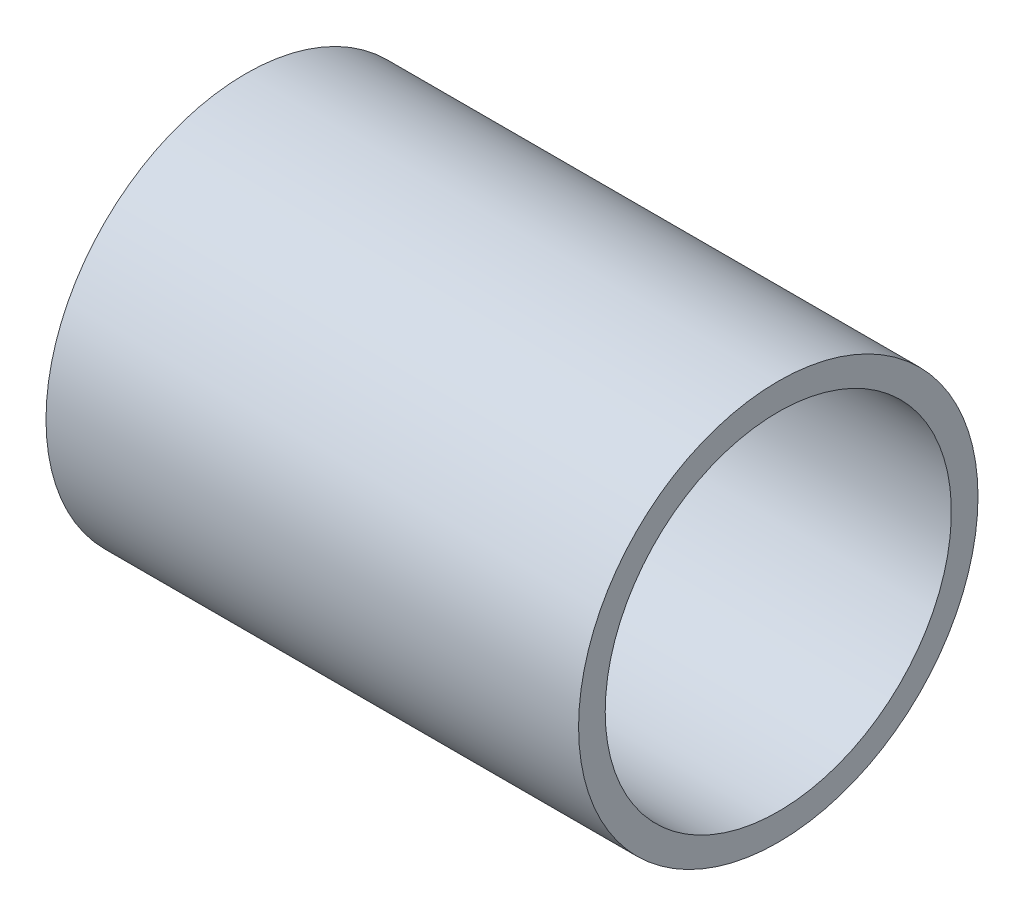
ISO-10303-21;
HEADER;
FILE_DESCRIPTION(('STEP AP214'),'2;1');
FILE_NAME('part.step','',(''),(''),'','','');
FILE_SCHEMA(('AUTOMOTIVE_DESIGN { 1 0 10303 214 1 1 1 1 }'));
ENDSEC;
DATA;
#1=APPLICATION_CONTEXT('core data for automotive mechanical design processes');
#2=APPLICATION_PROTOCOL_DEFINITION('international standard','automotive_design',2000,#1);
#3=PRODUCT_CONTEXT('',#1,'mechanical');
#4=PRODUCT('Part','Part','',(#3));
#5=PRODUCT_RELATED_PRODUCT_CATEGORY('part','',(#4));
#6=PRODUCT_DEFINITION_FORMATION('','',#4);
#7=PRODUCT_DEFINITION_CONTEXT('part definition',#1,'design');
#8=PRODUCT_DEFINITION('design','',#6,#7);
#9=PRODUCT_DEFINITION_SHAPE('','',#8);
#10=(LENGTH_UNIT() NAMED_UNIT(*) SI_UNIT(.MILLI.,.METRE.));
#11=(NAMED_UNIT(*) PLANE_ANGLE_UNIT() SI_UNIT($,.RADIAN.));
#12=(NAMED_UNIT(*) SI_UNIT($,.STERADIAN.) SOLID_ANGLE_UNIT());
#13=UNCERTAINTY_MEASURE_WITH_UNIT(LENGTH_MEASURE(1.E-05),#10,'distance_accuracy_value','');
#14=(GEOMETRIC_REPRESENTATION_CONTEXT(3) GLOBAL_UNCERTAINTY_ASSIGNED_CONTEXT((#13)) GLOBAL_UNIT_ASSIGNED_CONTEXT((#10,
#11,#12)) REPRESENTATION_CONTEXT('',''));
#15=CARTESIAN_POINT('',(0.,0.,0.));
#16=DIRECTION('',(0.,0.,1.));
#17=DIRECTION('',(1.,0.,0.));
#18=AXIS2_PLACEMENT_3D('',#15,#16,#17);
#19=CARTESIAN_POINT('',(0.,0.,0.));
#20=DIRECTION('',(-1.,0.,0.));
#21=DIRECTION('',(0.,0.,1.));
#22=AXIS2_PLACEMENT_3D('',#19,#20,#21);
#23=CYLINDRICAL_SURFACE('',#22,95.25);
#24=CARTESIAN_POINT('',(254.,0.,0.));
#25=DIRECTION('',(-1.,0.,0.));
#26=DIRECTION('',(0.,0.,1.));
#27=AXIS2_PLACEMENT_3D('',#24,#25,#26);
#28=CIRCLE('',#27,95.25);
#29=CARTESIAN_POINT('',(254.,0.,95.25));
#30=VERTEX_POINT('',#29);
#31=EDGE_CURVE('E45',#30,#30,#28,.T.);
#32=ORIENTED_EDGE('',*,*,#31,.T.);
#33=EDGE_LOOP('',(#32));
#34=FACE_BOUND('',#33,.T.);
#35=CARTESIAN_POINT('',(0.,0.,0.));
#36=DIRECTION('',(-1.,0.,0.));
#37=DIRECTION('',(0.,0.,1.));
#38=AXIS2_PLACEMENT_3D('',#35,#36,#37);
#39=CIRCLE('',#38,95.25);
#40=CARTESIAN_POINT('',(0.,0.,95.25));
#41=VERTEX_POINT('',#40);
#42=EDGE_CURVE('E10',#41,#41,#39,.T.);
#43=ORIENTED_EDGE('',*,*,#42,.F.);
#44=EDGE_LOOP('',(#43));
#45=FACE_BOUND('',#44,.T.);
#46=ADVANCED_FACE('F31',(#34,#45),#23,.T.);
#47=CARTESIAN_POINT('',(0.,0.,95.25));
#48=DIRECTION('',(1.,0.,0.));
#49=DIRECTION('',(0.,0.,-1.));
#50=AXIS2_PLACEMENT_3D('',#47,#48,#49);
#51=PLANE('',#50);
#52=CARTESIAN_POINT('',(0.,0.,0.));
#53=DIRECTION('',(-1.,0.,0.));
#54=DIRECTION('',(0.,0.,1.));
#55=AXIS2_PLACEMENT_3D('',#52,#53,#54);
#56=CIRCLE('',#55,82.55);
#57=CARTESIAN_POINT('',(0.,0.,82.55));
#58=VERTEX_POINT('',#57);
#59=EDGE_CURVE('E37',#58,#58,#56,.T.);
#60=ORIENTED_EDGE('',*,*,#59,.F.);
#61=EDGE_LOOP('',(#60));
#62=FACE_BOUND('',#61,.T.);
#63=ORIENTED_EDGE('',*,*,#42,.T.);
#64=EDGE_LOOP('',(#63));
#65=FACE_BOUND('',#64,.T.);
#66=ADVANCED_FACE('F61',(#62,#65),#51,.F.);
#67=CARTESIAN_POINT('',(0.,0.,0.));
#68=DIRECTION('',(-1.,0.,0.));
#69=DIRECTION('',(0.,0.,1.));
#70=AXIS2_PLACEMENT_3D('',#67,#68,#69);
#71=CYLINDRICAL_SURFACE('',#70,82.55);
#72=CARTESIAN_POINT('',(254.,0.,0.));
#73=DIRECTION('',(-1.,0.,0.));
#74=DIRECTION('',(0.,0.,1.));
#75=AXIS2_PLACEMENT_3D('',#72,#73,#74);
#76=CIRCLE('',#75,82.55);
#77=CARTESIAN_POINT('',(254.,0.,82.55));
#78=VERTEX_POINT('',#77);
#79=EDGE_CURVE('E41',#78,#78,#76,.T.);
#80=ORIENTED_EDGE('',*,*,#79,.F.);
#81=EDGE_LOOP('',(#80));
#82=FACE_BOUND('',#81,.T.);
#83=ORIENTED_EDGE('',*,*,#59,.T.);
#84=EDGE_LOOP('',(#83));
#85=FACE_BOUND('',#84,.T.);
#86=ADVANCED_FACE('F56',(#82,#85),#71,.F.);
#87=CARTESIAN_POINT('',(254.,0.,82.55));
#88=DIRECTION('',(-1.,0.,0.));
#89=DIRECTION('',(0.,0.,1.));
#90=AXIS2_PLACEMENT_3D('',#87,#88,#89);
#91=PLANE('',#90);
#92=ORIENTED_EDGE('',*,*,#31,.F.);
#93=EDGE_LOOP('',(#92));
#94=FACE_BOUND('',#93,.T.);
#95=ORIENTED_EDGE('',*,*,#79,.T.);
#96=EDGE_LOOP('',(#95));
#97=FACE_BOUND('',#96,.T.);
#98=ADVANCED_FACE('F53',(#94,#97),#91,.F.);
#99=CLOSED_SHELL('',(#46,#66,#86,#98));
#100=MANIFOLD_SOLID_BREP('B2',#99);
#101=ADVANCED_BREP_SHAPE_REPRESENTATION('',(#18,#100),#14);
#102=SHAPE_DEFINITION_REPRESENTATION(#9,#101);
ENDSEC;
END-ISO-10303-21;
